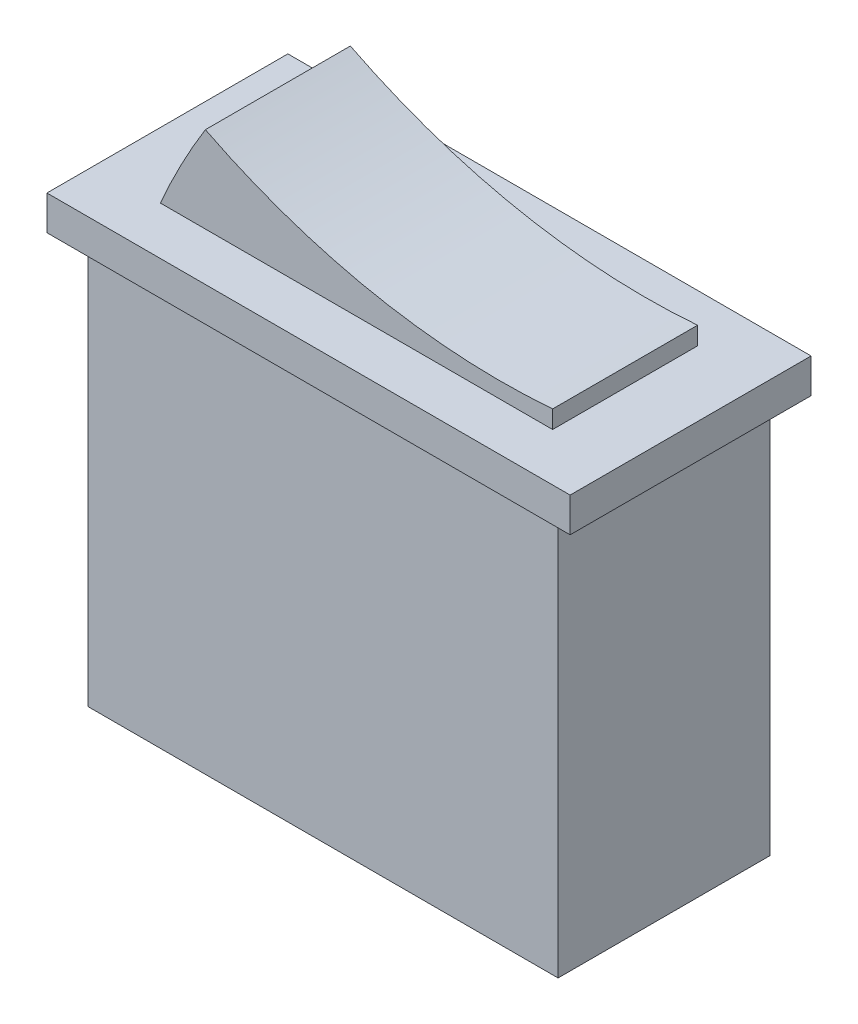
ISO-10303-21;
HEADER;
FILE_DESCRIPTION(('STEP AP214'),'2;1');
FILE_NAME('part.step','',(''),(''),'','','');
FILE_SCHEMA(('AUTOMOTIVE_DESIGN { 1 0 10303 214 1 1 1 1 }'));
ENDSEC;
DATA;
#1=APPLICATION_CONTEXT('core data for automotive mechanical design processes');
#2=APPLICATION_PROTOCOL_DEFINITION('international standard','automotive_design',2000,#1);
#3=PRODUCT_CONTEXT('',#1,'mechanical');
#4=PRODUCT('Part','Part','',(#3));
#5=PRODUCT_RELATED_PRODUCT_CATEGORY('part','',(#4));
#6=PRODUCT_DEFINITION_FORMATION('','',#4);
#7=PRODUCT_DEFINITION_CONTEXT('part definition',#1,'design');
#8=PRODUCT_DEFINITION('design','',#6,#7);
#9=PRODUCT_DEFINITION_SHAPE('','',#8);
#10=(LENGTH_UNIT() NAMED_UNIT(*) SI_UNIT(.MILLI.,.METRE.));
#11=(NAMED_UNIT(*) PLANE_ANGLE_UNIT() SI_UNIT($,.RADIAN.));
#12=(NAMED_UNIT(*) SI_UNIT($,.STERADIAN.) SOLID_ANGLE_UNIT());
#13=UNCERTAINTY_MEASURE_WITH_UNIT(LENGTH_MEASURE(1.E-05),#10,'distance_accuracy_value','');
#14=(GEOMETRIC_REPRESENTATION_CONTEXT(3) GLOBAL_UNCERTAINTY_ASSIGNED_CONTEXT((#13)) GLOBAL_UNIT_ASSIGNED_CONTEXT((#10,
#11,#12)) REPRESENTATION_CONTEXT('',''));
#15=CARTESIAN_POINT('',(0.,0.,0.));
#16=DIRECTION('',(0.,0.,1.));
#17=DIRECTION('',(1.,0.,0.));
#18=AXIS2_PLACEMENT_3D('',#15,#16,#17);
#19=CARTESIAN_POINT('',(0.,25.5,0.));
#20=DIRECTION('',(0.,1.,0.));
#21=DIRECTION('',(0.,0.,1.));
#22=AXIS2_PLACEMENT_3D('',#19,#20,#21);
#23=PLANE('',#22);
#24=DIRECTION('',(1.,0.,0.));
#25=VECTOR('',#24,1.);
#26=CARTESIAN_POINT('',(-11.3941764921606,25.5,4.21069468558244));
#27=LINE('',#26,#25);
#28=CARTESIAN_POINT('',(-11.3941764921606,25.5,4.21069468558244));
#29=VERTEX_POINT('',#28);
#30=CARTESIAN_POINT('',(11.3941764921606,25.5,4.21069468558244));
#31=VERTEX_POINT('',#30);
#32=EDGE_CURVE('E289',#29,#31,#27,.T.);
#33=ORIENTED_EDGE('',*,*,#32,.F.);
#34=DIRECTION('',(0.,0.,1.));
#35=VECTOR('',#34,1.);
#36=CARTESIAN_POINT('',(-11.3941764921606,25.5,4.21069468558244));
#37=LINE('',#36,#35);
#38=CARTESIAN_POINT('',(-11.3941764921606,25.5,-4.21069468558244));
#39=VERTEX_POINT('',#38);
#40=EDGE_CURVE('E48',#39,#29,#37,.T.);
#41=ORIENTED_EDGE('',*,*,#40,.F.);
#42=DIRECTION('',(-1.,0.,0.));
#43=VECTOR('',#42,1.);
#44=CARTESIAN_POINT('',(-11.3941764921606,25.5,-4.21069468558244));
#45=LINE('',#44,#43);
#46=CARTESIAN_POINT('',(11.3941764921606,25.5,-4.21069468558244));
#47=VERTEX_POINT('',#46);
#48=EDGE_CURVE('E280',#47,#39,#45,.T.);
#49=ORIENTED_EDGE('',*,*,#48,.F.);
#50=DIRECTION('',(0.,0.,-1.));
#51=VECTOR('',#50,1.);
#52=CARTESIAN_POINT('',(11.3941764921606,25.5,4.21069468558244));
#53=LINE('',#52,#51);
#54=EDGE_CURVE('E286',#31,#47,#53,.T.);
#55=ORIENTED_EDGE('',*,*,#54,.F.);
#56=EDGE_LOOP('',(#33,#41,#49,#55));
#57=FACE_BOUND('',#56,.T.);
#58=DIRECTION('',(1.,0.,0.));
#59=VECTOR('',#58,1.);
#60=CARTESIAN_POINT('',(-15.2,25.5,7.));
#61=LINE('',#60,#59);
#62=CARTESIAN_POINT('',(-15.2,25.5,7.));
#63=VERTEX_POINT('',#62);
#64=CARTESIAN_POINT('',(15.2,25.5,7.));
#65=VERTEX_POINT('',#64);
#66=EDGE_CURVE('E302',#63,#65,#61,.T.);
#67=ORIENTED_EDGE('',*,*,#66,.T.);
#68=DIRECTION('',(0.,0.,-1.));
#69=VECTOR('',#68,1.);
#70=CARTESIAN_POINT('',(15.2,25.5,-7.));
#71=LINE('',#70,#69);
#72=CARTESIAN_POINT('',(15.2,25.5,-7.));
#73=VERTEX_POINT('',#72);
#74=EDGE_CURVE('E306',#65,#73,#71,.T.);
#75=ORIENTED_EDGE('',*,*,#74,.T.);
#76=DIRECTION('',(-1.,0.,0.));
#77=VECTOR('',#76,1.);
#78=CARTESIAN_POINT('',(-15.2,25.5,-7.));
#79=LINE('',#78,#77);
#80=CARTESIAN_POINT('',(-15.2,25.5,-7.));
#81=VERTEX_POINT('',#80);
#82=EDGE_CURVE('E309',#73,#81,#79,.T.);
#83=ORIENTED_EDGE('',*,*,#82,.T.);
#84=DIRECTION('',(0.,0.,1.));
#85=VECTOR('',#84,1.);
#86=CARTESIAN_POINT('',(-15.2,25.5,-7.));
#87=LINE('',#86,#85);
#88=EDGE_CURVE('E299',#81,#63,#87,.T.);
#89=ORIENTED_EDGE('',*,*,#88,.T.);
#90=EDGE_LOOP('',(#67,#75,#83,#89));
#91=FACE_BOUND('',#90,.T.);
#92=ADVANCED_FACE('F33',(#57,#91),#23,.T.);
#93=CARTESIAN_POINT('',(-13.65,23.5,-6.15));
#94=DIRECTION('',(1.,0.,0.));
#95=DIRECTION('',(0.,0.,-1.));
#96=AXIS2_PLACEMENT_3D('',#93,#94,#95);
#97=PLANE('',#96);
#98=DIRECTION('',(0.,0.,1.));
#99=VECTOR('',#98,1.);
#100=CARTESIAN_POINT('',(-13.65,0.,-6.15));
#101=LINE('',#100,#99);
#102=CARTESIAN_POINT('',(-13.65,0.,-6.15));
#103=VERTEX_POINT('',#102);
#104=CARTESIAN_POINT('',(-13.65,0.,6.15));
#105=VERTEX_POINT('',#104);
#106=EDGE_CURVE('E96',#103,#105,#101,.T.);
#107=ORIENTED_EDGE('',*,*,#106,.T.);
#108=DIRECTION('',(0.,-1.,0.));
#109=VECTOR('',#108,1.);
#110=CARTESIAN_POINT('',(-13.65,23.5,6.15));
#111=LINE('',#110,#109);
#112=CARTESIAN_POINT('',(-13.65,23.5,6.15));
#113=VERTEX_POINT('',#112);
#114=EDGE_CURVE('E11',#113,#105,#111,.T.);
#115=ORIENTED_EDGE('',*,*,#114,.F.);
#116=DIRECTION('',(0.,0.,1.));
#117=VECTOR('',#116,1.);
#118=CARTESIAN_POINT('',(-13.65,23.5,-6.15));
#119=LINE('',#118,#117);
#120=CARTESIAN_POINT('',(-13.65,23.5,-6.15));
#121=VERTEX_POINT('',#120);
#122=EDGE_CURVE('E97',#121,#113,#119,.T.);
#123=ORIENTED_EDGE('',*,*,#122,.F.);
#124=DIRECTION('',(0.,-1.,0.));
#125=VECTOR('',#124,1.);
#126=CARTESIAN_POINT('',(-13.65,23.5,-6.15));
#127=LINE('',#126,#125);
#128=EDGE_CURVE('E83',#121,#103,#127,.T.);
#129=ORIENTED_EDGE('',*,*,#128,.T.);
#130=EDGE_LOOP('',(#107,#115,#123,#129));
#131=FACE_BOUND('',#130,.T.);
#132=ADVANCED_FACE('F35',(#131),#97,.F.);
#133=CARTESIAN_POINT('',(-13.65,23.5,6.15));
#134=DIRECTION('',(0.,0.,-1.));
#135=DIRECTION('',(-1.,0.,0.));
#136=AXIS2_PLACEMENT_3D('',#133,#134,#135);
#137=PLANE('',#136);
#138=DIRECTION('',(1.,0.,0.));
#139=VECTOR('',#138,1.);
#140=CARTESIAN_POINT('',(-13.65,0.,6.15));
#141=LINE('',#140,#139);
#142=CARTESIAN_POINT('',(13.65,0.,6.15));
#143=VERTEX_POINT('',#142);
#144=EDGE_CURVE('E91',#105,#143,#141,.T.);
#145=ORIENTED_EDGE('',*,*,#144,.T.);
#146=DIRECTION('',(0.,-1.,0.));
#147=VECTOR('',#146,1.);
#148=CARTESIAN_POINT('',(13.65,23.5,6.15));
#149=LINE('',#148,#147);
#150=CARTESIAN_POINT('',(13.65,23.5,6.15));
#151=VERTEX_POINT('',#150);
#152=EDGE_CURVE('E41',#151,#143,#149,.T.);
#153=ORIENTED_EDGE('',*,*,#152,.F.);
#154=DIRECTION('',(1.,0.,0.));
#155=VECTOR('',#154,1.);
#156=CARTESIAN_POINT('',(-13.65,23.5,6.15));
#157=LINE('',#156,#155);
#158=EDGE_CURVE('E100',#113,#151,#157,.T.);
#159=ORIENTED_EDGE('',*,*,#158,.F.);
#160=ORIENTED_EDGE('',*,*,#114,.T.);
#161=EDGE_LOOP('',(#145,#153,#159,#160));
#162=FACE_BOUND('',#161,.T.);
#163=ADVANCED_FACE('F112',(#162),#137,.F.);
#164=CARTESIAN_POINT('',(13.65,23.5,-6.15));
#165=DIRECTION('',(1.,0.,0.));
#166=DIRECTION('',(0.,0.,-1.));
#167=AXIS2_PLACEMENT_3D('',#164,#165,#166);
#168=PLANE('',#167);
#169=DIRECTION('',(0.,0.,1.));
#170=VECTOR('',#169,1.);
#171=CARTESIAN_POINT('',(13.65,0.,-6.15));
#172=LINE('',#171,#170);
#173=CARTESIAN_POINT('',(13.65,0.,-6.15));
#174=VERTEX_POINT('',#173);
#175=EDGE_CURVE('E86',#174,#143,#172,.T.);
#176=ORIENTED_EDGE('',*,*,#175,.F.);
#177=DIRECTION('',(0.,-1.,0.));
#178=VECTOR('',#177,1.);
#179=CARTESIAN_POINT('',(13.65,23.5,-6.15));
#180=LINE('',#179,#178);
#181=CARTESIAN_POINT('',(13.65,23.5,-6.15));
#182=VERTEX_POINT('',#181);
#183=EDGE_CURVE('E75',#182,#174,#180,.T.);
#184=ORIENTED_EDGE('',*,*,#183,.F.);
#185=DIRECTION('',(0.,0.,1.));
#186=VECTOR('',#185,1.);
#187=CARTESIAN_POINT('',(13.65,23.5,-6.15));
#188=LINE('',#187,#186);
#189=EDGE_CURVE('E57',#182,#151,#188,.T.);
#190=ORIENTED_EDGE('',*,*,#189,.T.);
#191=ORIENTED_EDGE('',*,*,#152,.T.);
#192=EDGE_LOOP('',(#176,#184,#190,#191));
#193=FACE_BOUND('',#192,.T.);
#194=ADVANCED_FACE('F87',(#193),#168,.T.);
#195=CARTESIAN_POINT('',(-13.65,23.5,-6.15));
#196=DIRECTION('',(0.,0.,-1.));
#197=DIRECTION('',(-1.,0.,0.));
#198=AXIS2_PLACEMENT_3D('',#195,#196,#197);
#199=PLANE('',#198);
#200=DIRECTION('',(1.,0.,0.));
#201=VECTOR('',#200,1.);
#202=CARTESIAN_POINT('',(-13.65,0.,-6.15));
#203=LINE('',#202,#201);
#204=EDGE_CURVE('E80',#103,#174,#203,.T.);
#205=ORIENTED_EDGE('',*,*,#204,.F.);
#206=ORIENTED_EDGE('',*,*,#128,.F.);
#207=DIRECTION('',(1.,0.,0.));
#208=VECTOR('',#207,1.);
#209=CARTESIAN_POINT('',(-13.65,23.5,-6.15));
#210=LINE('',#209,#208);
#211=EDGE_CURVE('E81',#121,#182,#210,.T.);
#212=ORIENTED_EDGE('',*,*,#211,.T.);
#213=ORIENTED_EDGE('',*,*,#183,.T.);
#214=EDGE_LOOP('',(#205,#206,#212,#213));
#215=FACE_BOUND('',#214,.T.);
#216=ADVANCED_FACE('F77',(#215),#199,.T.);
#217=CARTESIAN_POINT('',(0.,0.,0.));
#218=DIRECTION('',(0.,1.,0.));
#219=DIRECTION('',(0.,0.,1.));
#220=AXIS2_PLACEMENT_3D('',#217,#218,#219);
#221=PLANE('',#220);
#222=ORIENTED_EDGE('',*,*,#106,.F.);
#223=ORIENTED_EDGE('',*,*,#204,.T.);
#224=ORIENTED_EDGE('',*,*,#175,.T.);
#225=ORIENTED_EDGE('',*,*,#144,.F.);
#226=EDGE_LOOP('',(#222,#223,#224,#225));
#227=FACE_BOUND('',#226,.T.);
#228=ADVANCED_FACE('F94',(#227),#221,.F.);
#229=CARTESIAN_POINT('',(0.,23.5,0.));
#230=DIRECTION('',(0.,1.,0.));
#231=DIRECTION('',(0.,0.,1.));
#232=AXIS2_PLACEMENT_3D('',#229,#230,#231);
#233=PLANE('',#232);
#234=DIRECTION('',(0.,0.,1.));
#235=VECTOR('',#234,1.);
#236=CARTESIAN_POINT('',(-15.2,23.5,-7.));
#237=LINE('',#236,#235);
#238=CARTESIAN_POINT('',(-15.2,23.5,-7.));
#239=VERTEX_POINT('',#238);
#240=CARTESIAN_POINT('',(-15.2,23.5,7.));
#241=VERTEX_POINT('',#240);
#242=EDGE_CURVE('E298',#239,#241,#237,.T.);
#243=ORIENTED_EDGE('',*,*,#242,.F.);
#244=DIRECTION('',(-1.,0.,0.));
#245=VECTOR('',#244,1.);
#246=CARTESIAN_POINT('',(-15.2,23.5,-7.));
#247=LINE('',#246,#245);
#248=CARTESIAN_POINT('',(15.2,23.5,-7.));
#249=VERTEX_POINT('',#248);
#250=EDGE_CURVE('E303',#249,#239,#247,.T.);
#251=ORIENTED_EDGE('',*,*,#250,.F.);
#252=DIRECTION('',(0.,0.,-1.));
#253=VECTOR('',#252,1.);
#254=CARTESIAN_POINT('',(15.2,23.5,-7.));
#255=LINE('',#254,#253);
#256=CARTESIAN_POINT('',(15.2,23.5,7.));
#257=VERTEX_POINT('',#256);
#258=EDGE_CURVE('E318',#257,#249,#255,.T.);
#259=ORIENTED_EDGE('',*,*,#258,.F.);
#260=DIRECTION('',(1.,0.,0.));
#261=VECTOR('',#260,1.);
#262=CARTESIAN_POINT('',(-15.2,23.5,7.));
#263=LINE('',#262,#261);
#264=EDGE_CURVE('E315',#241,#257,#263,.T.);
#265=ORIENTED_EDGE('',*,*,#264,.F.);
#266=EDGE_LOOP('',(#243,#251,#259,#265));
#267=FACE_BOUND('',#266,.T.);
#268=ORIENTED_EDGE('',*,*,#211,.F.);
#269=ORIENTED_EDGE('',*,*,#122,.T.);
#270=ORIENTED_EDGE('',*,*,#158,.T.);
#271=ORIENTED_EDGE('',*,*,#189,.F.);
#272=EDGE_LOOP('',(#268,#269,#270,#271));
#273=FACE_BOUND('',#272,.T.);
#274=ADVANCED_FACE('F131',(#267,#273),#233,.F.);
#275=CARTESIAN_POINT('',(-15.2,25.5,-7.));
#276=DIRECTION('',(1.,0.,0.));
#277=DIRECTION('',(0.,0.,-1.));
#278=AXIS2_PLACEMENT_3D('',#275,#276,#277);
#279=PLANE('',#278);
#280=ORIENTED_EDGE('',*,*,#242,.T.);
#281=DIRECTION('',(0.,-1.,0.));
#282=VECTOR('',#281,1.);
#283=CARTESIAN_POINT('',(-15.2,25.5,7.));
#284=LINE('',#283,#282);
#285=EDGE_CURVE('E110',#63,#241,#284,.T.);
#286=ORIENTED_EDGE('',*,*,#285,.F.);
#287=ORIENTED_EDGE('',*,*,#88,.F.);
#288=DIRECTION('',(0.,-1.,0.));
#289=VECTOR('',#288,1.);
#290=CARTESIAN_POINT('',(-15.2,25.5,-7.));
#291=LINE('',#290,#289);
#292=EDGE_CURVE('E312',#81,#239,#291,.T.);
#293=ORIENTED_EDGE('',*,*,#292,.T.);
#294=EDGE_LOOP('',(#280,#286,#287,#293));
#295=FACE_BOUND('',#294,.T.);
#296=ADVANCED_FACE('F134',(#295),#279,.F.);
#297=CARTESIAN_POINT('',(-15.2,25.5,7.));
#298=DIRECTION('',(0.,0.,-1.));
#299=DIRECTION('',(-1.,0.,0.));
#300=AXIS2_PLACEMENT_3D('',#297,#298,#299);
#301=PLANE('',#300);
#302=ORIENTED_EDGE('',*,*,#264,.T.);
#303=DIRECTION('',(0.,-1.,0.));
#304=VECTOR('',#303,1.);
#305=CARTESIAN_POINT('',(15.2,25.5,7.));
#306=LINE('',#305,#304);
#307=EDGE_CURVE('E328',#65,#257,#306,.T.);
#308=ORIENTED_EDGE('',*,*,#307,.F.);
#309=ORIENTED_EDGE('',*,*,#66,.F.);
#310=ORIENTED_EDGE('',*,*,#285,.T.);
#311=EDGE_LOOP('',(#302,#308,#309,#310));
#312=FACE_BOUND('',#311,.T.);
#313=ADVANCED_FACE('F143',(#312),#301,.F.);
#314=CARTESIAN_POINT('',(15.2,25.5,-7.));
#315=DIRECTION('',(-1.,0.,0.));
#316=DIRECTION('',(0.,0.,1.));
#317=AXIS2_PLACEMENT_3D('',#314,#315,#316);
#318=PLANE('',#317);
#319=ORIENTED_EDGE('',*,*,#258,.T.);
#320=DIRECTION('',(0.,-1.,0.));
#321=VECTOR('',#320,1.);
#322=CARTESIAN_POINT('',(15.2,25.5,-7.));
#323=LINE('',#322,#321);
#324=EDGE_CURVE('E325',#73,#249,#323,.T.);
#325=ORIENTED_EDGE('',*,*,#324,.F.);
#326=ORIENTED_EDGE('',*,*,#74,.F.);
#327=ORIENTED_EDGE('',*,*,#307,.T.);
#328=EDGE_LOOP('',(#319,#325,#326,#327));
#329=FACE_BOUND('',#328,.T.);
#330=ADVANCED_FACE('F139',(#329),#318,.F.);
#331=CARTESIAN_POINT('',(-15.2,25.5,-7.));
#332=DIRECTION('',(0.,0.,1.));
#333=DIRECTION('',(1.,0.,0.));
#334=AXIS2_PLACEMENT_3D('',#331,#332,#333);
#335=PLANE('',#334);
#336=ORIENTED_EDGE('',*,*,#250,.T.);
#337=ORIENTED_EDGE('',*,*,#292,.F.);
#338=ORIENTED_EDGE('',*,*,#82,.F.);
#339=ORIENTED_EDGE('',*,*,#324,.T.);
#340=EDGE_LOOP('',(#336,#337,#338,#339));
#341=FACE_BOUND('',#340,.T.);
#342=ADVANCED_FACE('F136',(#341),#335,.F.);
#343=CARTESIAN_POINT('',(11.3941764921606,30.5,4.21069468558244));
#344=DIRECTION('',(-1.,0.,0.));
#345=DIRECTION('',(0.,0.,1.));
#346=AXIS2_PLACEMENT_3D('',#343,#344,#345);
#347=PLANE('',#346);
#348=DIRECTION('',(0.,-1.,0.));
#349=VECTOR('',#348,1.);
#350=CARTESIAN_POINT('',(11.3941764921606,30.5,-4.21069468558244));
#351=LINE('',#350,#349);
#352=CARTESIAN_POINT('',(11.3941764921606,26.537935188955,-4.21069468558244));
#353=VERTEX_POINT('',#352);
#354=EDGE_CURVE('E283',#353,#47,#351,.T.);
#355=ORIENTED_EDGE('',*,*,#354,.F.);
#356=DIRECTION('',(0.,0.,-1.));
#357=VECTOR('',#356,1.);
#358=CARTESIAN_POINT('',(11.3941764921606,26.537935188955,64.2991427747221));
#359=LINE('',#358,#357);
#360=CARTESIAN_POINT('',(11.3941764921606,26.537935188955,4.21069468558244));
#361=VERTEX_POINT('',#360);
#362=EDGE_CURVE('E365',#361,#353,#359,.T.);
#363=ORIENTED_EDGE('',*,*,#362,.F.);
#364=DIRECTION('',(0.,-1.,0.));
#365=VECTOR('',#364,1.);
#366=CARTESIAN_POINT('',(11.3941764921606,30.5,4.21069468558244));
#367=LINE('',#366,#365);
#368=EDGE_CURVE('E291',#361,#31,#367,.T.);
#369=ORIENTED_EDGE('',*,*,#368,.T.);
#370=ORIENTED_EDGE('',*,*,#54,.T.);
#371=EDGE_LOOP('',(#355,#363,#369,#370));
#372=FACE_BOUND('',#371,.T.);
#373=ADVANCED_FACE('F129',(#372),#347,.F.);
#374=CARTESIAN_POINT('',(-11.3941764921606,30.5,-4.21069468558244));
#375=DIRECTION('',(0.,0.,1.));
#376=DIRECTION('',(1.,0.,0.));
#377=AXIS2_PLACEMENT_3D('',#374,#375,#376);
#378=PLANE('',#377);
#379=CARTESIAN_POINT('',(23.5864382044575,10.4014373052682,-4.21069468558244));
#380=DIRECTION('',(0.,0.,1.));
#381=DIRECTION('',(1.,0.,0.));
#382=AXIS2_PLACEMENT_3D('',#379,#380,#381);
#383=CIRCLE('',#382,38.1);
#384=CARTESIAN_POINT('',(-8.78110383391689,30.5,-4.21069468558244));
#385=VERTEX_POINT('',#384);
#386=EDGE_CURVE('E267',#39,#385,#383,.F.);
#387=ORIENTED_EDGE('',*,*,#386,.T.);
#388=CARTESIAN_POINT('',(8.37614529425943,64.5182128036394,-4.21069468558244));
#389=DIRECTION('',(0.,0.,1.));
#390=DIRECTION('',(1.,0.,0.));
#391=AXIS2_PLACEMENT_3D('',#388,#389,#390);
#392=CIRCLE('',#391,38.1);
#393=EDGE_CURVE('E368',#385,#353,#392,.T.);
#394=ORIENTED_EDGE('',*,*,#393,.T.);
#395=ORIENTED_EDGE('',*,*,#354,.T.);
#396=ORIENTED_EDGE('',*,*,#48,.T.);
#397=EDGE_LOOP('',(#387,#394,#395,#396));
#398=FACE_BOUND('',#397,.T.);
#399=ADVANCED_FACE('F194',(#398),#378,.F.);
#400=CARTESIAN_POINT('',(-11.3941764921606,30.5,4.21069468558244));
#401=DIRECTION('',(0.,0.,-1.));
#402=DIRECTION('',(-1.,0.,0.));
#403=AXIS2_PLACEMENT_3D('',#400,#401,#402);
#404=PLANE('',#403);
#405=ORIENTED_EDGE('',*,*,#368,.F.);
#406=CARTESIAN_POINT('',(8.37614529425943,64.5182128036394,4.21069468558244));
#407=DIRECTION('',(0.,0.,-1.));
#408=DIRECTION('',(-1.,0.,0.));
#409=AXIS2_PLACEMENT_3D('',#406,#407,#408);
#410=CIRCLE('',#409,38.1);
#411=CARTESIAN_POINT('',(-8.78110383391689,30.5,4.21069468558244));
#412=VERTEX_POINT('',#411);
#413=EDGE_CURVE('E275',#361,#412,#410,.T.);
#414=ORIENTED_EDGE('',*,*,#413,.T.);
#415=CARTESIAN_POINT('',(23.5864382044575,10.4014373052682,4.21069468558244));
#416=DIRECTION('',(0.,0.,-1.));
#417=DIRECTION('',(-1.,0.,0.));
#418=AXIS2_PLACEMENT_3D('',#415,#416,#417);
#419=CIRCLE('',#418,38.1);
#420=EDGE_CURVE('E276',#412,#29,#419,.F.);
#421=ORIENTED_EDGE('',*,*,#420,.T.);
#422=ORIENTED_EDGE('',*,*,#32,.T.);
#423=EDGE_LOOP('',(#405,#414,#421,#422));
#424=FACE_BOUND('',#423,.T.);
#425=ADVANCED_FACE('F201',(#424),#404,.F.);
#426=CARTESIAN_POINT('',(8.37614529425943,64.5182128036394,64.2991427747221));
#427=DIRECTION('',(0.,0.,-1.));
#428=DIRECTION('',(-1.,0.,0.));
#429=AXIS2_PLACEMENT_3D('',#426,#427,#428);
#430=CYLINDRICAL_SURFACE('',#429,38.1);
#431=ORIENTED_EDGE('',*,*,#393,.F.);
#432=DIRECTION('',(0.,0.,-1.));
#433=VECTOR('',#432,1.);
#434=CARTESIAN_POINT('',(-8.78110383391689,30.5,64.2991427747221));
#435=LINE('',#434,#433);
#436=EDGE_CURVE('E271',#412,#385,#435,.T.);
#437=ORIENTED_EDGE('',*,*,#436,.F.);
#438=ORIENTED_EDGE('',*,*,#413,.F.);
#439=ORIENTED_EDGE('',*,*,#362,.T.);
#440=EDGE_LOOP('',(#431,#437,#438,#439));
#441=FACE_BOUND('',#440,.T.);
#442=ADVANCED_FACE('F208',(#441),#430,.F.);
#443=CARTESIAN_POINT('',(23.5864382044575,10.4014373052682,64.2991427747221));
#444=DIRECTION('',(0.,0.,-1.));
#445=DIRECTION('',(-1.,0.,0.));
#446=AXIS2_PLACEMENT_3D('',#443,#444,#445);
#447=CYLINDRICAL_SURFACE('',#446,38.1);
#448=ORIENTED_EDGE('',*,*,#386,.F.);
#449=ORIENTED_EDGE('',*,*,#40,.T.);
#450=ORIENTED_EDGE('',*,*,#420,.F.);
#451=ORIENTED_EDGE('',*,*,#436,.T.);
#452=EDGE_LOOP('',(#448,#449,#450,#451));
#453=FACE_BOUND('',#452,.T.);
#454=ADVANCED_FACE('F216',(#453),#447,.T.);
#455=CLOSED_SHELL('',(#92,#132,#163,#194,#216,#228,#274,#296,#313,#330,#342,#373,#399,#425,#442,#454));
#456=MANIFOLD_SOLID_BREP('B2',#455);
#457=ADVANCED_BREP_SHAPE_REPRESENTATION('',(#18,#456),#14);
#458=SHAPE_DEFINITION_REPRESENTATION(#9,#457);
ENDSEC;
END-ISO-10303-21;
